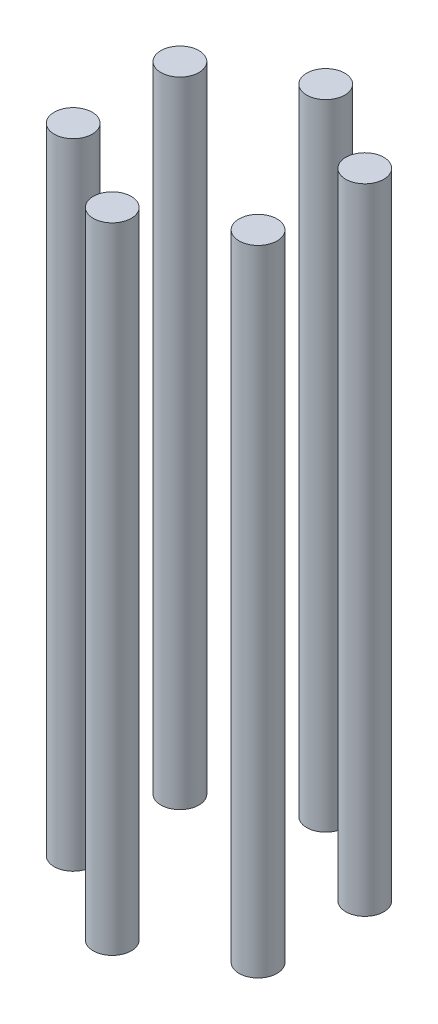
ISO-10303-21;
HEADER;
FILE_DESCRIPTION(('STEP AP214'),'2;1');
FILE_NAME('part.step','',(''),(''),'','','');
FILE_SCHEMA(('AUTOMOTIVE_DESIGN { 1 0 10303 214 1 1 1 1 }'));
ENDSEC;
DATA;
#1=APPLICATION_CONTEXT('core data for automotive mechanical design processes');
#2=APPLICATION_PROTOCOL_DEFINITION('international standard','automotive_design',2000,#1);
#3=PRODUCT_CONTEXT('',#1,'mechanical');
#4=PRODUCT('Part','Part','',(#3));
#5=PRODUCT_RELATED_PRODUCT_CATEGORY('part','',(#4));
#6=PRODUCT_DEFINITION_FORMATION('','',#4);
#7=PRODUCT_DEFINITION_CONTEXT('part definition',#1,'design');
#8=PRODUCT_DEFINITION('design','',#6,#7);
#9=PRODUCT_DEFINITION_SHAPE('','',#8);
#10=(LENGTH_UNIT() NAMED_UNIT(*) SI_UNIT(.MILLI.,.METRE.));
#11=(NAMED_UNIT(*) PLANE_ANGLE_UNIT() SI_UNIT($,.RADIAN.));
#12=(NAMED_UNIT(*) SI_UNIT($,.STERADIAN.) SOLID_ANGLE_UNIT());
#13=UNCERTAINTY_MEASURE_WITH_UNIT(LENGTH_MEASURE(1.E-05),#10,'distance_accuracy_value','');
#14=(GEOMETRIC_REPRESENTATION_CONTEXT(3) GLOBAL_UNCERTAINTY_ASSIGNED_CONTEXT((#13)) GLOBAL_UNIT_ASSIGNED_CONTEXT((#10,
#11,#12)) REPRESENTATION_CONTEXT('',''));
#15=CARTESIAN_POINT('',(0.,0.,0.));
#16=DIRECTION('',(0.,0.,1.));
#17=DIRECTION('',(1.,0.,0.));
#18=AXIS2_PLACEMENT_3D('',#15,#16,#17);
#19=CARTESIAN_POINT('',(18.9399488772411,130.,10.9349845827129));
#20=DIRECTION('',(0.,-1.,0.));
#21=DIRECTION('',(0.,0.,-1.));
#22=AXIS2_PLACEMENT_3D('',#19,#20,#21);
#23=CYLINDRICAL_SURFACE('',#22,3.90000000000003);
#24=CARTESIAN_POINT('',(18.9399488772411,130.,10.9349845827129));
#25=DIRECTION('',(0.,1.,0.));
#26=DIRECTION('',(0.,0.,1.));
#27=AXIS2_PLACEMENT_3D('',#24,#25,#26);
#28=CIRCLE('',#27,3.90000000000003);
#29=CARTESIAN_POINT('',(18.9399488772411,130.,14.8349845827129));
#30=VERTEX_POINT('',#29);
#31=EDGE_CURVE('E13',#30,#30,#28,.T.);
#32=ORIENTED_EDGE('',*,*,#31,.F.);
#33=EDGE_LOOP('',(#32));
#34=FACE_BOUND('',#33,.T.);
#35=CARTESIAN_POINT('',(18.9399488772411,0.,10.9349845827129));
#36=DIRECTION('',(0.,1.,0.));
#37=DIRECTION('',(0.,0.,1.));
#38=AXIS2_PLACEMENT_3D('',#35,#36,#37);
#39=CIRCLE('',#38,3.90000000000003);
#40=CARTESIAN_POINT('',(18.9399488772411,0.,14.8349845827129));
#41=VERTEX_POINT('',#40);
#42=EDGE_CURVE('E60',#41,#41,#39,.T.);
#43=ORIENTED_EDGE('',*,*,#42,.T.);
#44=EDGE_LOOP('',(#43));
#45=FACE_BOUND('',#44,.T.);
#46=ADVANCED_FACE('F57',(#34,#45),#23,.T.);
#47=CARTESIAN_POINT('',(18.9399488772411,130.,10.9349845827129));
#48=DIRECTION('',(0.,1.,0.));
#49=DIRECTION('',(0.,0.,1.));
#50=AXIS2_PLACEMENT_3D('',#47,#48,#49);
#51=PLANE('',#50);
#52=ORIENTED_EDGE('',*,*,#31,.T.);
#53=EDGE_LOOP('',(#52));
#54=FACE_BOUND('',#53,.T.);
#55=ADVANCED_FACE('F72',(#54),#51,.T.);
#56=CARTESIAN_POINT('',(18.9399488772411,0.,10.9349845827129));
#57=DIRECTION('',(0.,1.,0.));
#58=DIRECTION('',(0.,0.,1.));
#59=AXIS2_PLACEMENT_3D('',#56,#57,#58);
#60=PLANE('',#59);
#61=ORIENTED_EDGE('',*,*,#42,.F.);
#62=EDGE_LOOP('',(#61));
#63=FACE_BOUND('',#62,.T.);
#64=ADVANCED_FACE('F70',(#63),#60,.F.);
#65=CLOSED_SHELL('',(#46,#55,#64));
#66=MANIFOLD_SOLID_BREP('B2',#65);
#67=CARTESIAN_POINT('',(18.9399488772411,130.,-10.9349845827129));
#68=DIRECTION('',(0.,-1.,0.));
#69=DIRECTION('',(0.,0.,-1.));
#70=AXIS2_PLACEMENT_3D('',#67,#68,#69);
#71=CYLINDRICAL_SURFACE('',#70,3.89999999999999);
#72=CARTESIAN_POINT('',(18.9399488772411,130.,-10.9349845827129));
#73=DIRECTION('',(0.,1.,0.));
#74=DIRECTION('',(0.,0.,1.));
#75=AXIS2_PLACEMENT_3D('',#72,#73,#74);
#76=CIRCLE('',#75,3.89999999999999);
#77=CARTESIAN_POINT('',(18.9399488772411,130.,-7.03498458271292));
#78=VERTEX_POINT('',#77);
#79=EDGE_CURVE('E56',#78,#78,#76,.T.);
#80=ORIENTED_EDGE('',*,*,#79,.F.);
#81=EDGE_LOOP('',(#80));
#82=FACE_BOUND('',#81,.T.);
#83=CARTESIAN_POINT('',(18.9399488772411,0.,-10.9349845827129));
#84=DIRECTION('',(0.,1.,0.));
#85=DIRECTION('',(0.,0.,1.));
#86=AXIS2_PLACEMENT_3D('',#83,#84,#85);
#87=CIRCLE('',#86,3.89999999999999);
#88=CARTESIAN_POINT('',(18.9399488772411,0.,-7.03498458271292));
#89=VERTEX_POINT('',#88);
#90=EDGE_CURVE('E118',#89,#89,#87,.T.);
#91=ORIENTED_EDGE('',*,*,#90,.T.);
#92=EDGE_LOOP('',(#91));
#93=FACE_BOUND('',#92,.T.);
#94=ADVANCED_FACE('F115',(#82,#93),#71,.T.);
#95=CARTESIAN_POINT('',(18.9399488772411,130.,-10.9349845827129));
#96=DIRECTION('',(0.,1.,0.));
#97=DIRECTION('',(0.,0.,1.));
#98=AXIS2_PLACEMENT_3D('',#95,#96,#97);
#99=PLANE('',#98);
#100=ORIENTED_EDGE('',*,*,#79,.T.);
#101=EDGE_LOOP('',(#100));
#102=FACE_BOUND('',#101,.T.);
#103=ADVANCED_FACE('F130',(#102),#99,.T.);
#104=CARTESIAN_POINT('',(18.9399488772411,0.,-10.9349845827129));
#105=DIRECTION('',(0.,1.,0.));
#106=DIRECTION('',(0.,0.,1.));
#107=AXIS2_PLACEMENT_3D('',#104,#105,#106);
#108=PLANE('',#107);
#109=ORIENTED_EDGE('',*,*,#90,.F.);
#110=EDGE_LOOP('',(#109));
#111=FACE_BOUND('',#110,.T.);
#112=ADVANCED_FACE('F128',(#111),#108,.F.);
#113=CLOSED_SHELL('',(#94,#103,#112));
#114=MANIFOLD_SOLID_BREP('B8',#113);
#115=CARTESIAN_POINT('',(0.,130.,-21.8699691654258));
#116=DIRECTION('',(0.,-1.,0.));
#117=DIRECTION('',(0.,0.,-1.));
#118=AXIS2_PLACEMENT_3D('',#115,#116,#117);
#119=CYLINDRICAL_SURFACE('',#118,3.89999999999999);
#120=CARTESIAN_POINT('',(0.,130.,-21.8699691654258));
#121=DIRECTION('',(0.,1.,0.));
#122=DIRECTION('',(0.,0.,1.));
#123=AXIS2_PLACEMENT_3D('',#120,#121,#122);
#124=CIRCLE('',#123,3.89999999999999);
#125=CARTESIAN_POINT('',(0.,130.,-17.9699691654258));
#126=VERTEX_POINT('',#125);
#127=EDGE_CURVE('E114',#126,#126,#124,.T.);
#128=ORIENTED_EDGE('',*,*,#127,.F.);
#129=EDGE_LOOP('',(#128));
#130=FACE_BOUND('',#129,.T.);
#131=CARTESIAN_POINT('',(0.,0.,-21.8699691654258));
#132=DIRECTION('',(0.,1.,0.));
#133=DIRECTION('',(0.,0.,1.));
#134=AXIS2_PLACEMENT_3D('',#131,#132,#133);
#135=CIRCLE('',#134,3.89999999999999);
#136=CARTESIAN_POINT('',(0.,0.,-17.9699691654258));
#137=VERTEX_POINT('',#136);
#138=EDGE_CURVE('E176',#137,#137,#135,.T.);
#139=ORIENTED_EDGE('',*,*,#138,.T.);
#140=EDGE_LOOP('',(#139));
#141=FACE_BOUND('',#140,.T.);
#142=ADVANCED_FACE('F173',(#130,#141),#119,.T.);
#143=CARTESIAN_POINT('',(0.,130.,-21.8699691654258));
#144=DIRECTION('',(0.,1.,0.));
#145=DIRECTION('',(0.,0.,1.));
#146=AXIS2_PLACEMENT_3D('',#143,#144,#145);
#147=PLANE('',#146);
#148=ORIENTED_EDGE('',*,*,#127,.T.);
#149=EDGE_LOOP('',(#148));
#150=FACE_BOUND('',#149,.T.);
#151=ADVANCED_FACE('F188',(#150),#147,.T.);
#152=CARTESIAN_POINT('',(0.,0.,-21.8699691654258));
#153=DIRECTION('',(0.,1.,0.));
#154=DIRECTION('',(0.,0.,1.));
#155=AXIS2_PLACEMENT_3D('',#152,#153,#154);
#156=PLANE('',#155);
#157=ORIENTED_EDGE('',*,*,#138,.F.);
#158=EDGE_LOOP('',(#157));
#159=FACE_BOUND('',#158,.T.);
#160=ADVANCED_FACE('F186',(#159),#156,.F.);
#161=CLOSED_SHELL('',(#142,#151,#160));
#162=MANIFOLD_SOLID_BREP('B51',#161);
#163=CARTESIAN_POINT('',(-18.9399488772411,130.,-10.9349845827129));
#164=DIRECTION('',(0.,-1.,0.));
#165=DIRECTION('',(0.,0.,-1.));
#166=AXIS2_PLACEMENT_3D('',#163,#164,#165);
#167=CYLINDRICAL_SURFACE('',#166,3.89999999999999);
#168=CARTESIAN_POINT('',(-18.9399488772411,130.,-10.9349845827129));
#169=DIRECTION('',(0.,1.,0.));
#170=DIRECTION('',(0.,0.,1.));
#171=AXIS2_PLACEMENT_3D('',#168,#169,#170);
#172=CIRCLE('',#171,3.89999999999999);
#173=CARTESIAN_POINT('',(-18.9399488772411,130.,-7.03498458271292));
#174=VERTEX_POINT('',#173);
#175=EDGE_CURVE('E172',#174,#174,#172,.T.);
#176=ORIENTED_EDGE('',*,*,#175,.F.);
#177=EDGE_LOOP('',(#176));
#178=FACE_BOUND('',#177,.T.);
#179=CARTESIAN_POINT('',(-18.9399488772411,0.,-10.9349845827129));
#180=DIRECTION('',(0.,1.,0.));
#181=DIRECTION('',(0.,0.,1.));
#182=AXIS2_PLACEMENT_3D('',#179,#180,#181);
#183=CIRCLE('',#182,3.89999999999999);
#184=CARTESIAN_POINT('',(-18.9399488772411,0.,-7.03498458271292));
#185=VERTEX_POINT('',#184);
#186=EDGE_CURVE('E234',#185,#185,#183,.T.);
#187=ORIENTED_EDGE('',*,*,#186,.T.);
#188=EDGE_LOOP('',(#187));
#189=FACE_BOUND('',#188,.T.);
#190=ADVANCED_FACE('F231',(#178,#189),#167,.T.);
#191=CARTESIAN_POINT('',(-18.9399488772411,130.,-10.9349845827129));
#192=DIRECTION('',(0.,1.,0.));
#193=DIRECTION('',(0.,0.,1.));
#194=AXIS2_PLACEMENT_3D('',#191,#192,#193);
#195=PLANE('',#194);
#196=ORIENTED_EDGE('',*,*,#175,.T.);
#197=EDGE_LOOP('',(#196));
#198=FACE_BOUND('',#197,.T.);
#199=ADVANCED_FACE('F246',(#198),#195,.T.);
#200=CARTESIAN_POINT('',(-18.9399488772411,0.,-10.9349845827129));
#201=DIRECTION('',(0.,1.,0.));
#202=DIRECTION('',(0.,0.,1.));
#203=AXIS2_PLACEMENT_3D('',#200,#201,#202);
#204=PLANE('',#203);
#205=ORIENTED_EDGE('',*,*,#186,.F.);
#206=EDGE_LOOP('',(#205));
#207=FACE_BOUND('',#206,.T.);
#208=ADVANCED_FACE('F244',(#207),#204,.F.);
#209=CLOSED_SHELL('',(#190,#199,#208));
#210=MANIFOLD_SOLID_BREP('B109',#209);
#211=CARTESIAN_POINT('',(-18.9399488772411,130.,10.9349845827129));
#212=DIRECTION('',(0.,-1.,0.));
#213=DIRECTION('',(0.,0.,-1.));
#214=AXIS2_PLACEMENT_3D('',#211,#212,#213);
#215=CYLINDRICAL_SURFACE('',#214,3.89999999999999);
#216=CARTESIAN_POINT('',(-18.9399488772411,130.,10.9349845827129));
#217=DIRECTION('',(0.,1.,0.));
#218=DIRECTION('',(0.,0.,1.));
#219=AXIS2_PLACEMENT_3D('',#216,#217,#218);
#220=CIRCLE('',#219,3.89999999999999);
#221=CARTESIAN_POINT('',(-18.9399488772411,130.,14.8349845827129));
#222=VERTEX_POINT('',#221);
#223=EDGE_CURVE('E230',#222,#222,#220,.T.);
#224=ORIENTED_EDGE('',*,*,#223,.F.);
#225=EDGE_LOOP('',(#224));
#226=FACE_BOUND('',#225,.T.);
#227=CARTESIAN_POINT('',(-18.9399488772411,0.,10.9349845827129));
#228=DIRECTION('',(0.,1.,0.));
#229=DIRECTION('',(0.,0.,1.));
#230=AXIS2_PLACEMENT_3D('',#227,#228,#229);
#231=CIRCLE('',#230,3.89999999999999);
#232=CARTESIAN_POINT('',(-18.9399488772411,0.,14.8349845827129));
#233=VERTEX_POINT('',#232);
#234=EDGE_CURVE('E291',#233,#233,#231,.T.);
#235=ORIENTED_EDGE('',*,*,#234,.T.);
#236=EDGE_LOOP('',(#235));
#237=FACE_BOUND('',#236,.T.);
#238=ADVANCED_FACE('F288',(#226,#237),#215,.T.);
#239=CARTESIAN_POINT('',(-18.9399488772411,130.,10.9349845827129));
#240=DIRECTION('',(0.,1.,0.));
#241=DIRECTION('',(0.,0.,1.));
#242=AXIS2_PLACEMENT_3D('',#239,#240,#241);
#243=PLANE('',#242);
#244=ORIENTED_EDGE('',*,*,#223,.T.);
#245=EDGE_LOOP('',(#244));
#246=FACE_BOUND('',#245,.T.);
#247=ADVANCED_FACE('F303',(#246),#243,.T.);
#248=CARTESIAN_POINT('',(-18.9399488772411,0.,10.9349845827129));
#249=DIRECTION('',(0.,1.,0.));
#250=DIRECTION('',(0.,0.,1.));
#251=AXIS2_PLACEMENT_3D('',#248,#249,#250);
#252=PLANE('',#251);
#253=ORIENTED_EDGE('',*,*,#234,.F.);
#254=EDGE_LOOP('',(#253));
#255=FACE_BOUND('',#254,.T.);
#256=ADVANCED_FACE('F301',(#255),#252,.F.);
#257=CLOSED_SHELL('',(#238,#247,#256));
#258=MANIFOLD_SOLID_BREP('B167',#257);
#259=CARTESIAN_POINT('',(0.,130.,21.8699691654258));
#260=DIRECTION('',(0.,-1.,0.));
#261=DIRECTION('',(0.,0.,-1.));
#262=AXIS2_PLACEMENT_3D('',#259,#260,#261);
#263=CYLINDRICAL_SURFACE('',#262,3.9);
#264=CARTESIAN_POINT('',(0.,130.,21.8699691654258));
#265=DIRECTION('',(0.,1.,0.));
#266=DIRECTION('',(0.,0.,1.));
#267=AXIS2_PLACEMENT_3D('',#264,#265,#266);
#268=CIRCLE('',#267,3.9);
#269=CARTESIAN_POINT('',(0.,130.,25.7699691654258));
#270=VERTEX_POINT('',#269);
#271=EDGE_CURVE('E287',#270,#270,#268,.T.);
#272=ORIENTED_EDGE('',*,*,#271,.F.);
#273=EDGE_LOOP('',(#272));
#274=FACE_BOUND('',#273,.T.);
#275=CARTESIAN_POINT('',(0.,0.,21.8699691654258));
#276=DIRECTION('',(0.,1.,0.));
#277=DIRECTION('',(0.,0.,1.));
#278=AXIS2_PLACEMENT_3D('',#275,#276,#277);
#279=CIRCLE('',#278,3.9);
#280=CARTESIAN_POINT('',(0.,0.,25.7699691654258));
#281=VERTEX_POINT('',#280);
#282=EDGE_CURVE('E339',#281,#281,#279,.T.);
#283=ORIENTED_EDGE('',*,*,#282,.T.);
#284=EDGE_LOOP('',(#283));
#285=FACE_BOUND('',#284,.T.);
#286=ADVANCED_FACE('F336',(#274,#285),#263,.T.);
#287=CARTESIAN_POINT('',(0.,130.,21.8699691654258));
#288=DIRECTION('',(0.,1.,0.));
#289=DIRECTION('',(0.,0.,1.));
#290=AXIS2_PLACEMENT_3D('',#287,#288,#289);
#291=PLANE('',#290);
#292=ORIENTED_EDGE('',*,*,#271,.T.);
#293=EDGE_LOOP('',(#292));
#294=FACE_BOUND('',#293,.T.);
#295=ADVANCED_FACE('F351',(#294),#291,.T.);
#296=CARTESIAN_POINT('',(0.,0.,21.8699691654258));
#297=DIRECTION('',(0.,1.,0.));
#298=DIRECTION('',(0.,0.,1.));
#299=AXIS2_PLACEMENT_3D('',#296,#297,#298);
#300=PLANE('',#299);
#301=ORIENTED_EDGE('',*,*,#282,.F.);
#302=EDGE_LOOP('',(#301));
#303=FACE_BOUND('',#302,.T.);
#304=ADVANCED_FACE('F349',(#303),#300,.F.);
#305=CLOSED_SHELL('',(#286,#295,#304));
#306=MANIFOLD_SOLID_BREP('B225',#305);
#307=ADVANCED_BREP_SHAPE_REPRESENTATION('',(#18,#66,#114,#162,#210,#258,#306),#14);
#308=SHAPE_DEFINITION_REPRESENTATION(#9,#307);
ENDSEC;
END-ISO-10303-21;
